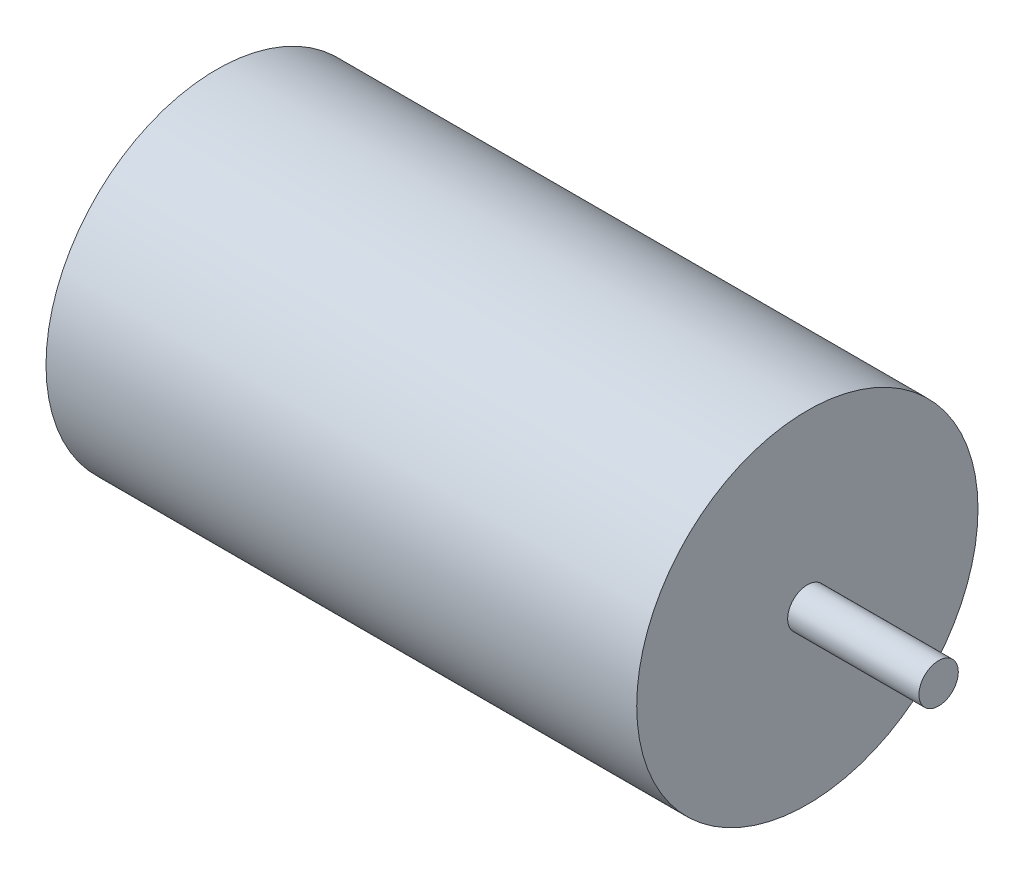
ISO-10303-21;
HEADER;
FILE_DESCRIPTION(('STEP AP214'),'2;1');
FILE_NAME('part.step','',(''),(''),'','','');
FILE_SCHEMA(('AUTOMOTIVE_DESIGN { 1 0 10303 214 1 1 1 1 }'));
ENDSEC;
DATA;
#1=APPLICATION_CONTEXT('core data for automotive mechanical design processes');
#2=APPLICATION_PROTOCOL_DEFINITION('international standard','automotive_design',2000,#1);
#3=PRODUCT_CONTEXT('',#1,'mechanical');
#4=PRODUCT('Part','Part','',(#3));
#5=PRODUCT_RELATED_PRODUCT_CATEGORY('part','',(#4));
#6=PRODUCT_DEFINITION_FORMATION('','',#4);
#7=PRODUCT_DEFINITION_CONTEXT('part definition',#1,'design');
#8=PRODUCT_DEFINITION('design','',#6,#7);
#9=PRODUCT_DEFINITION_SHAPE('','',#8);
#10=(LENGTH_UNIT() NAMED_UNIT(*) SI_UNIT(.MILLI.,.METRE.));
#11=(NAMED_UNIT(*) PLANE_ANGLE_UNIT() SI_UNIT($,.RADIAN.));
#12=(NAMED_UNIT(*) SI_UNIT($,.STERADIAN.) SOLID_ANGLE_UNIT());
#13=UNCERTAINTY_MEASURE_WITH_UNIT(LENGTH_MEASURE(1.E-05),#10,'distance_accuracy_value','');
#14=(GEOMETRIC_REPRESENTATION_CONTEXT(3) GLOBAL_UNCERTAINTY_ASSIGNED_CONTEXT((#13)) GLOBAL_UNIT_ASSIGNED_CONTEXT((#10,
#11,#12)) REPRESENTATION_CONTEXT('',''));
#15=CARTESIAN_POINT('',(0.,0.,0.));
#16=DIRECTION('',(0.,0.,1.));
#17=DIRECTION('',(1.,0.,0.));
#18=AXIS2_PLACEMENT_3D('',#15,#16,#17);
#19=CARTESIAN_POINT('',(10.,0.,0.));
#20=DIRECTION('',(-1.,0.,0.));
#21=DIRECTION('',(0.,0.,1.));
#22=AXIS2_PLACEMENT_3D('',#19,#20,#21);
#23=CYLINDRICAL_SURFACE('',#22,1.5);
#24=CARTESIAN_POINT('',(10.,0.,0.));
#25=DIRECTION('',(1.,0.,0.));
#26=DIRECTION('',(0.,0.,-1.));
#27=AXIS2_PLACEMENT_3D('',#24,#25,#26);
#28=CIRCLE('',#27,1.5);
#29=CARTESIAN_POINT('',(10.,0.,-1.5));
#30=VERTEX_POINT('',#29);
#31=EDGE_CURVE('E10',#30,#30,#28,.T.);
#32=ORIENTED_EDGE('',*,*,#31,.F.);
#33=EDGE_LOOP('',(#32));
#34=FACE_BOUND('',#33,.T.);
#35=CARTESIAN_POINT('',(0.,0.,0.));
#36=DIRECTION('',(1.,0.,0.));
#37=DIRECTION('',(0.,0.,-1.));
#38=AXIS2_PLACEMENT_3D('',#35,#36,#37);
#39=CIRCLE('',#38,1.5);
#40=CARTESIAN_POINT('',(0.,0.,-1.5));
#41=VERTEX_POINT('',#40);
#42=EDGE_CURVE('E42',#41,#41,#39,.T.);
#43=ORIENTED_EDGE('',*,*,#42,.T.);
#44=EDGE_LOOP('',(#43));
#45=FACE_BOUND('',#44,.T.);
#46=ADVANCED_FACE('F39',(#34,#45),#23,.T.);
#47=CARTESIAN_POINT('',(10.,0.,0.));
#48=DIRECTION('',(1.,0.,0.));
#49=DIRECTION('',(0.,0.,-1.));
#50=AXIS2_PLACEMENT_3D('',#47,#48,#49);
#51=PLANE('',#50);
#52=ORIENTED_EDGE('',*,*,#31,.T.);
#53=EDGE_LOOP('',(#52));
#54=FACE_BOUND('',#53,.T.);
#55=ADVANCED_FACE('F70',(#54),#51,.T.);
#56=CARTESIAN_POINT('',(-45.,0.,0.));
#57=DIRECTION('',(1.,0.,0.));
#58=DIRECTION('',(0.,0.,-1.));
#59=AXIS2_PLACEMENT_3D('',#56,#57,#58);
#60=CYLINDRICAL_SURFACE('',#59,13.);
#61=CARTESIAN_POINT('',(-45.,0.,0.));
#62=DIRECTION('',(1.,0.,0.));
#63=DIRECTION('',(0.,0.,-1.));
#64=AXIS2_PLACEMENT_3D('',#61,#62,#63);
#65=CIRCLE('',#64,13.);
#66=CARTESIAN_POINT('',(-45.,0.,-13.));
#67=VERTEX_POINT('',#66);
#68=EDGE_CURVE('E49',#67,#67,#65,.T.);
#69=CARTESIAN_POINT('',(0.,0.,0.));
#70=DIRECTION('',(1.,0.,0.));
#71=DIRECTION('',(0.,0.,-1.));
#72=AXIS2_PLACEMENT_3D('',#69,#70,#71);
#73=CIRCLE('',#72,13.);
#74=CARTESIAN_POINT('',(0.,0.,-13.));
#75=VERTEX_POINT('',#74);
#76=EDGE_CURVE('E51',#75,#75,#73,.T.);
#77=CARTESIAN_POINT('',(-45.,0.,-13.));
#78=CARTESIAN_POINT('',(-44.53125,0.,-13.));
#79=CARTESIAN_POINT('',(-44.0625,0.,-13.));
#80=CARTESIAN_POINT('',(-43.125,0.,-13.));
#81=CARTESIAN_POINT('',(-42.65625,0.,-13.));
#82=CARTESIAN_POINT('',(-41.71875,0.,-13.));
#83=CARTESIAN_POINT('',(-41.25,0.,-13.));
#84=CARTESIAN_POINT('',(-40.3125,0.,-13.));
#85=CARTESIAN_POINT('',(-39.84375,0.,-13.));
#86=CARTESIAN_POINT('',(-38.90625,0.,-13.));
#87=CARTESIAN_POINT('',(-38.4375,0.,-13.));
#88=CARTESIAN_POINT('',(-37.5,0.,-13.));
#89=CARTESIAN_POINT('',(-37.03125,0.,-13.));
#90=CARTESIAN_POINT('',(-36.09375,0.,-13.));
#91=CARTESIAN_POINT('',(-35.625,0.,-13.));
#92=CARTESIAN_POINT('',(-34.6875,0.,-13.));
#93=CARTESIAN_POINT('',(-34.21875,0.,-13.));
#94=CARTESIAN_POINT('',(-33.28125,0.,-13.));
#95=CARTESIAN_POINT('',(-32.8125,0.,-13.));
#96=CARTESIAN_POINT('',(-31.875,0.,-13.));
#97=CARTESIAN_POINT('',(-31.40625,0.,-13.));
#98=CARTESIAN_POINT('',(-30.46875,0.,-13.));
#99=CARTESIAN_POINT('',(-30.,0.,-13.));
#100=CARTESIAN_POINT('',(-29.0625,0.,-13.));
#101=CARTESIAN_POINT('',(-28.59375,0.,-13.));
#102=CARTESIAN_POINT('',(-27.65625,0.,-13.));
#103=CARTESIAN_POINT('',(-27.1875,0.,-13.));
#104=CARTESIAN_POINT('',(-26.25,0.,-13.));
#105=CARTESIAN_POINT('',(-25.78125,0.,-13.));
#106=CARTESIAN_POINT('',(-24.84375,0.,-13.));
#107=CARTESIAN_POINT('',(-24.375,0.,-13.));
#108=CARTESIAN_POINT('',(-23.4375,0.,-13.));
#109=CARTESIAN_POINT('',(-22.96875,0.,-13.));
#110=CARTESIAN_POINT('',(-22.03125,0.,-13.));
#111=CARTESIAN_POINT('',(-21.5625,0.,-13.));
#112=CARTESIAN_POINT('',(-20.625,0.,-13.));
#113=CARTESIAN_POINT('',(-20.15625,0.,-13.));
#114=CARTESIAN_POINT('',(-19.21875,0.,-13.));
#115=CARTESIAN_POINT('',(-18.75,0.,-13.));
#116=CARTESIAN_POINT('',(-17.8125,0.,-13.));
#117=CARTESIAN_POINT('',(-17.34375,0.,-13.));
#118=CARTESIAN_POINT('',(-16.40625,0.,-13.));
#119=CARTESIAN_POINT('',(-15.9375,0.,-13.));
#120=CARTESIAN_POINT('',(-15.,0.,-13.));
#121=CARTESIAN_POINT('',(-14.53125,0.,-13.));
#122=CARTESIAN_POINT('',(-13.59375,0.,-13.));
#123=CARTESIAN_POINT('',(-13.125,0.,-13.));
#124=CARTESIAN_POINT('',(-12.1875,0.,-13.));
#125=CARTESIAN_POINT('',(-11.71875,0.,-13.));
#126=CARTESIAN_POINT('',(-10.78125,0.,-13.));
#127=CARTESIAN_POINT('',(-10.3125,0.,-13.));
#128=CARTESIAN_POINT('',(-9.37500000000001,0.,-13.));
#129=CARTESIAN_POINT('',(-8.90625000000001,0.,-13.));
#130=CARTESIAN_POINT('',(-7.96875000000001,0.,-13.));
#131=CARTESIAN_POINT('',(-7.50000000000001,0.,-13.));
#132=CARTESIAN_POINT('',(-6.56250000000001,0.,-13.));
#133=CARTESIAN_POINT('',(-6.09375000000001,0.,-13.));
#134=CARTESIAN_POINT('',(-5.15625000000001,0.,-13.));
#135=CARTESIAN_POINT('',(-4.68750000000001,0.,-13.));
#136=CARTESIAN_POINT('',(-3.75000000000001,0.,-13.));
#137=CARTESIAN_POINT('',(-3.28125000000001,0.,-13.));
#138=CARTESIAN_POINT('',(-2.34375000000001,0.,-13.));
#139=CARTESIAN_POINT('',(-1.87500000000001,0.,-13.));
#140=CARTESIAN_POINT('',(-0.937500000000006,0.,-13.));
#141=CARTESIAN_POINT('',(-0.468750000000007,0.,-13.));
#142=CARTESIAN_POINT('',(0.,0.,-13.));
#143=B_SPLINE_CURVE_WITH_KNOTS('',3,(#77,#78,#79,#80,#81,#82,#83,#84,#85,#86,#87,#88,#89,#90,
#91,#92,#93,#94,#95,#96,#97,#98,#99,#100,#101,#102,#103,#104,#105,#106,#107,#108,#109,#110,#111,
#112,#113,#114,#115,#116,#117,#118,#119,#120,#121,#122,#123,#124,#125,#126,#127,#128,#129,#130,
#131,#132,#133,#134,#135,#136,#137,#138,#139,#140,#141,#142),.UNSPECIFIED.,.F.,.F.,(4,2,2,2,2,2,
2,2,2,2,2,2,2,2,2,2,2,2,2,2,2,2,2,2,2,2,2,2,2,2,2,2,4),(0.,1.40625,2.8125,4.21874999999999,
5.625,7.03125,8.43749999999999,9.84375,11.25,12.65625,14.0625,15.46875,16.875,18.28125,19.6875,
21.09375,22.5,23.90625,25.3125,26.71875,28.125,29.53125,30.9375,32.34375,33.75,35.15625,36.5625,
37.96875,39.375,40.78125,42.1875,43.59375,45.),.UNSPECIFIED.);
#144=EDGE_CURVE('BSEAM57',#67,#75,#143,.T.);
#145=ORIENTED_EDGE('',*,*,#68,.T.);
#146=ORIENTED_EDGE('',*,*,#76,.F.);
#147=ORIENTED_EDGE('',*,*,#144,.T.);
#148=ORIENTED_EDGE('',*,*,#144,.F.);
#149=EDGE_LOOP('',(#145,#147,#146,#148));
#150=FACE_BOUND('',#149,.T.);
#151=ADVANCED_FACE('F57',(#150),#60,.T.);
#152=CARTESIAN_POINT('',(-45.,0.,0.));
#153=DIRECTION('',(1.,0.,0.));
#154=DIRECTION('',(0.,0.,-1.));
#155=AXIS2_PLACEMENT_3D('',#152,#153,#154);
#156=PLANE('',#155);
#157=ORIENTED_EDGE('',*,*,#68,.F.);
#158=EDGE_LOOP('',(#157));
#159=FACE_BOUND('',#158,.T.);
#160=ADVANCED_FACE('F60',(#159),#156,.F.);
#161=CARTESIAN_POINT('',(0.,0.,0.));
#162=DIRECTION('',(1.,0.,0.));
#163=DIRECTION('',(0.,0.,-1.));
#164=AXIS2_PLACEMENT_3D('',#161,#162,#163);
#165=PLANE('',#164);
#166=ORIENTED_EDGE('',*,*,#42,.F.);
#167=EDGE_LOOP('',(#166));
#168=FACE_BOUND('',#167,.T.);
#169=ORIENTED_EDGE('',*,*,#76,.T.);
#170=EDGE_LOOP('',(#169));
#171=FACE_BOUND('',#170,.T.);
#172=ADVANCED_FACE('F62',(#168,#171),#165,.T.);
#173=CLOSED_SHELL('',(#46,#55,#151,#160,#172));
#174=MANIFOLD_SOLID_BREP('B2',#173);
#175=ADVANCED_BREP_SHAPE_REPRESENTATION('',(#18,#174),#14);
#176=SHAPE_DEFINITION_REPRESENTATION(#9,#175);
ENDSEC;
END-ISO-10303-21;
